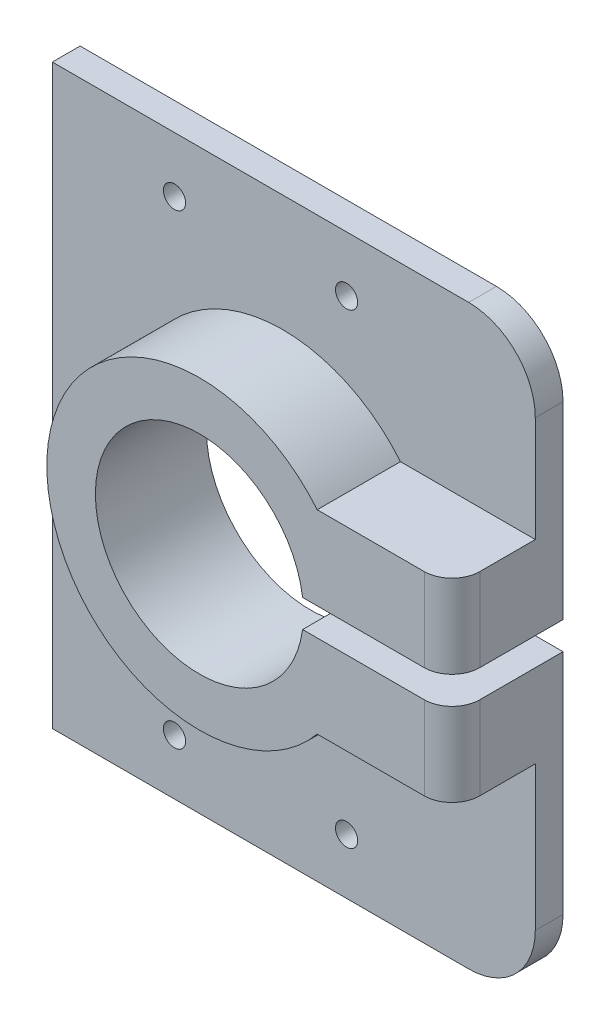
ISO-10303-21;
HEADER;
FILE_DESCRIPTION(('STEP AP214'),'2;1');
FILE_NAME('part.step','',(''),(''),'','','');
FILE_SCHEMA(('AUTOMOTIVE_DESIGN { 1 0 10303 214 1 1 1 1 }'));
ENDSEC;
DATA;
#1=APPLICATION_CONTEXT('core data for automotive mechanical design processes');
#2=APPLICATION_PROTOCOL_DEFINITION('international standard','automotive_design',2000,#1);
#3=PRODUCT_CONTEXT('',#1,'mechanical');
#4=PRODUCT('Part','Part','',(#3));
#5=PRODUCT_RELATED_PRODUCT_CATEGORY('part','',(#4));
#6=PRODUCT_DEFINITION_FORMATION('','',#4);
#7=PRODUCT_DEFINITION_CONTEXT('part definition',#1,'design');
#8=PRODUCT_DEFINITION('design','',#6,#7);
#9=PRODUCT_DEFINITION_SHAPE('','',#8);
#10=(LENGTH_UNIT() NAMED_UNIT(*) SI_UNIT(.MILLI.,.METRE.));
#11=(NAMED_UNIT(*) PLANE_ANGLE_UNIT() SI_UNIT($,.RADIAN.));
#12=(NAMED_UNIT(*) SI_UNIT($,.STERADIAN.) SOLID_ANGLE_UNIT());
#13=UNCERTAINTY_MEASURE_WITH_UNIT(LENGTH_MEASURE(1.E-05),#10,'distance_accuracy_value','');
#14=(GEOMETRIC_REPRESENTATION_CONTEXT(3) GLOBAL_UNCERTAINTY_ASSIGNED_CONTEXT((#13)) GLOBAL_UNIT_ASSIGNED_CONTEXT((#10,
#11,#12)) REPRESENTATION_CONTEXT('',''));
#15=CARTESIAN_POINT('',(0.,0.,0.));
#16=DIRECTION('',(0.,0.,1.));
#17=DIRECTION('',(1.,0.,0.));
#18=AXIS2_PLACEMENT_3D('',#15,#16,#17);
#19=CARTESIAN_POINT('',(43.5,0.,5.));
#20=DIRECTION('',(-1.,0.,0.));
#21=DIRECTION('',(0.,0.,1.));
#22=AXIS2_PLACEMENT_3D('',#19,#20,#21);
#23=PLANE('',#22);
#24=DIRECTION('',(0.,0.,-1.));
#25=VECTOR('',#24,1.);
#26=CARTESIAN_POINT('',(43.5,21.0000003129244,20.));
#27=LINE('',#26,#25);
#28=CARTESIAN_POINT('',(43.5,21.0000003129244,15.));
#29=VERTEX_POINT('',#28);
#30=CARTESIAN_POINT('',(43.5,21.0000003129244,5.));
#31=VERTEX_POINT('',#30);
#32=EDGE_CURVE('E201',#29,#31,#27,.T.);
#33=ORIENTED_EDGE('',*,*,#32,.F.);
#34=DIRECTION('',(0.,1.,0.));
#35=VECTOR('',#34,1.);
#36=CARTESIAN_POINT('',(43.5,6.,15.));
#37=LINE('',#36,#35);
#38=CARTESIAN_POINT('',(43.5,6.,15.));
#39=VERTEX_POINT('',#38);
#40=EDGE_CURVE('E43',#29,#39,#37,.F.);
#41=ORIENTED_EDGE('',*,*,#40,.T.);
#42=DIRECTION('',(0.,0.,-1.));
#43=VECTOR('',#42,1.);
#44=CARTESIAN_POINT('',(43.5,6.,20.));
#45=LINE('',#44,#43);
#46=CARTESIAN_POINT('',(43.5,6.,0.));
#47=VERTEX_POINT('',#46);
#48=EDGE_CURVE('E157',#39,#47,#45,.T.);
#49=ORIENTED_EDGE('',*,*,#48,.T.);
#50=DIRECTION('',(0.,1.,0.));
#51=VECTOR('',#50,1.);
#52=CARTESIAN_POINT('',(43.5,0.,0.));
#53=LINE('',#52,#51);
#54=CARTESIAN_POINT('',(43.5,40.,0.));
#55=VERTEX_POINT('',#54);
#56=EDGE_CURVE('E255',#47,#55,#53,.T.);
#57=ORIENTED_EDGE('',*,*,#56,.T.);
#58=DIRECTION('',(0.,0.,-1.));
#59=VECTOR('',#58,1.);
#60=CARTESIAN_POINT('',(43.5,40.,5.));
#61=LINE('',#60,#59);
#62=CARTESIAN_POINT('',(43.5,40.,5.));
#63=VERTEX_POINT('',#62);
#64=EDGE_CURVE('E292',#63,#55,#61,.T.);
#65=ORIENTED_EDGE('',*,*,#64,.F.);
#66=DIRECTION('',(0.,1.,0.));
#67=VECTOR('',#66,1.);
#68=CARTESIAN_POINT('',(43.5,0.,5.));
#69=LINE('',#68,#67);
#70=EDGE_CURVE('E220',#31,#63,#69,.T.);
#71=ORIENTED_EDGE('',*,*,#70,.F.);
#72=EDGE_LOOP('',(#33,#41,#49,#57,#65,#71));
#73=FACE_BOUND('',#72,.T.);
#74=ADVANCED_FACE('F35',(#73),#23,.F.);
#75=CARTESIAN_POINT('',(31.5,40.,5.));
#76=DIRECTION('',(0.,0.,-1.));
#77=DIRECTION('',(-1.,0.,0.));
#78=AXIS2_PLACEMENT_3D('',#75,#76,#77);
#79=CYLINDRICAL_SURFACE('',#78,12.);
#80=CARTESIAN_POINT('',(31.5,40.,0.));
#81=DIRECTION('',(0.,0.,1.));
#82=DIRECTION('',(1.,0.,0.));
#83=AXIS2_PLACEMENT_3D('',#80,#81,#82);
#84=CIRCLE('',#83,12.);
#85=CARTESIAN_POINT('',(31.5,52.,0.));
#86=VERTEX_POINT('',#85);
#87=EDGE_CURVE('E258',#55,#86,#84,.T.);
#88=ORIENTED_EDGE('',*,*,#87,.T.);
#89=DIRECTION('',(0.,0.,-1.));
#90=VECTOR('',#89,1.);
#91=CARTESIAN_POINT('',(31.5,52.,5.));
#92=LINE('',#91,#90);
#93=CARTESIAN_POINT('',(31.5,52.,5.));
#94=VERTEX_POINT('',#93);
#95=EDGE_CURVE('E289',#94,#86,#92,.T.);
#96=ORIENTED_EDGE('',*,*,#95,.F.);
#97=CARTESIAN_POINT('',(31.5,40.,5.));
#98=DIRECTION('',(0.,0.,1.));
#99=DIRECTION('',(1.,0.,0.));
#100=AXIS2_PLACEMENT_3D('',#97,#98,#99);
#101=CIRCLE('',#100,12.);
#102=EDGE_CURVE('E223',#63,#94,#101,.T.);
#103=ORIENTED_EDGE('',*,*,#102,.F.);
#104=ORIENTED_EDGE('',*,*,#64,.T.);
#105=EDGE_LOOP('',(#88,#96,#103,#104));
#106=FACE_BOUND('',#105,.T.);
#107=ADVANCED_FACE('F350',(#106),#79,.T.);
#108=CARTESIAN_POINT('',(0.,52.,5.));
#109=DIRECTION('',(0.,-1.,0.));
#110=DIRECTION('',(0.,0.,-1.));
#111=AXIS2_PLACEMENT_3D('',#108,#109,#110);
#112=PLANE('',#111);
#113=DIRECTION('',(-1.,0.,0.));
#114=VECTOR('',#113,1.);
#115=CARTESIAN_POINT('',(0.,52.,0.));
#116=LINE('',#115,#114);
#117=CARTESIAN_POINT('',(-43.5,52.,0.));
#118=VERTEX_POINT('',#117);
#119=EDGE_CURVE('E261',#86,#118,#116,.T.);
#120=ORIENTED_EDGE('',*,*,#119,.T.);
#121=DIRECTION('',(0.,0.,-1.));
#122=VECTOR('',#121,1.);
#123=CARTESIAN_POINT('',(-43.5,52.,5.));
#124=LINE('',#123,#122);
#125=CARTESIAN_POINT('',(-43.5,52.,5.));
#126=VERTEX_POINT('',#125);
#127=EDGE_CURVE('E286',#126,#118,#124,.T.);
#128=ORIENTED_EDGE('',*,*,#127,.F.);
#129=DIRECTION('',(-1.,0.,0.));
#130=VECTOR('',#129,1.);
#131=CARTESIAN_POINT('',(0.,52.,5.));
#132=LINE('',#131,#130);
#133=EDGE_CURVE('E226',#94,#126,#132,.T.);
#134=ORIENTED_EDGE('',*,*,#133,.F.);
#135=ORIENTED_EDGE('',*,*,#95,.T.);
#136=EDGE_LOOP('',(#120,#128,#134,#135));
#137=FACE_BOUND('',#136,.T.);
#138=ADVANCED_FACE('F346',(#137),#112,.F.);
#139=CARTESIAN_POINT('',(-43.5,0.,5.));
#140=DIRECTION('',(1.,0.,0.));
#141=DIRECTION('',(0.,0.,-1.));
#142=AXIS2_PLACEMENT_3D('',#139,#140,#141);
#143=PLANE('',#142);
#144=DIRECTION('',(0.,-1.,0.));
#145=VECTOR('',#144,1.);
#146=CARTESIAN_POINT('',(-43.5,0.,0.));
#147=LINE('',#146,#145);
#148=CARTESIAN_POINT('',(-43.5,-52.,0.));
#149=VERTEX_POINT('',#148);
#150=EDGE_CURVE('E264',#118,#149,#147,.T.);
#151=ORIENTED_EDGE('',*,*,#150,.T.);
#152=DIRECTION('',(0.,0.,-1.));
#153=VECTOR('',#152,1.);
#154=CARTESIAN_POINT('',(-43.5,-52.,5.));
#155=LINE('',#154,#153);
#156=CARTESIAN_POINT('',(-43.5,-52.,5.));
#157=VERTEX_POINT('',#156);
#158=EDGE_CURVE('E283',#157,#149,#155,.T.);
#159=ORIENTED_EDGE('',*,*,#158,.F.);
#160=DIRECTION('',(0.,-1.,0.));
#161=VECTOR('',#160,1.);
#162=CARTESIAN_POINT('',(-43.5,0.,5.));
#163=LINE('',#162,#161);
#164=EDGE_CURVE('E229',#126,#157,#163,.T.);
#165=ORIENTED_EDGE('',*,*,#164,.F.);
#166=ORIENTED_EDGE('',*,*,#127,.T.);
#167=EDGE_LOOP('',(#151,#159,#165,#166));
#168=FACE_BOUND('',#167,.T.);
#169=ADVANCED_FACE('F343',(#168),#143,.F.);
#170=CARTESIAN_POINT('',(0.,-52.,5.));
#171=DIRECTION('',(0.,1.,0.));
#172=DIRECTION('',(0.,0.,1.));
#173=AXIS2_PLACEMENT_3D('',#170,#171,#172);
#174=PLANE('',#173);
#175=DIRECTION('',(1.,0.,0.));
#176=VECTOR('',#175,1.);
#177=CARTESIAN_POINT('',(0.,-52.,0.));
#178=LINE('',#177,#176);
#179=CARTESIAN_POINT('',(31.5,-52.,0.));
#180=VERTEX_POINT('',#179);
#181=EDGE_CURVE('E267',#149,#180,#178,.T.);
#182=ORIENTED_EDGE('',*,*,#181,.T.);
#183=DIRECTION('',(0.,0.,-1.));
#184=VECTOR('',#183,1.);
#185=CARTESIAN_POINT('',(31.5,-52.,5.));
#186=LINE('',#185,#184);
#187=CARTESIAN_POINT('',(31.5,-52.,5.));
#188=VERTEX_POINT('',#187);
#189=EDGE_CURVE('E280',#188,#180,#186,.T.);
#190=ORIENTED_EDGE('',*,*,#189,.F.);
#191=DIRECTION('',(1.,0.,0.));
#192=VECTOR('',#191,1.);
#193=CARTESIAN_POINT('',(0.,-52.,5.));
#194=LINE('',#193,#192);
#195=EDGE_CURVE('E232',#157,#188,#194,.T.);
#196=ORIENTED_EDGE('',*,*,#195,.F.);
#197=ORIENTED_EDGE('',*,*,#158,.T.);
#198=EDGE_LOOP('',(#182,#190,#196,#197));
#199=FACE_BOUND('',#198,.T.);
#200=ADVANCED_FACE('F341',(#199),#174,.F.);
#201=CARTESIAN_POINT('',(31.5,-40.,5.));
#202=DIRECTION('',(0.,0.,-1.));
#203=DIRECTION('',(-1.,0.,0.));
#204=AXIS2_PLACEMENT_3D('',#201,#202,#203);
#205=CYLINDRICAL_SURFACE('',#204,12.);
#206=CARTESIAN_POINT('',(31.5,-40.,0.));
#207=DIRECTION('',(0.,0.,1.));
#208=DIRECTION('',(1.,0.,0.));
#209=AXIS2_PLACEMENT_3D('',#206,#207,#208);
#210=CIRCLE('',#209,12.);
#211=CARTESIAN_POINT('',(43.5,-40.,0.));
#212=VERTEX_POINT('',#211);
#213=EDGE_CURVE('E270',#180,#212,#210,.T.);
#214=ORIENTED_EDGE('',*,*,#213,.T.);
#215=DIRECTION('',(0.,0.,-1.));
#216=VECTOR('',#215,1.);
#217=CARTESIAN_POINT('',(43.5,-40.,5.));
#218=LINE('',#217,#216);
#219=CARTESIAN_POINT('',(43.5,-40.,5.));
#220=VERTEX_POINT('',#219);
#221=EDGE_CURVE('E246',#220,#212,#218,.T.);
#222=ORIENTED_EDGE('',*,*,#221,.F.);
#223=CARTESIAN_POINT('',(31.5,-40.,5.));
#224=DIRECTION('',(0.,0.,1.));
#225=DIRECTION('',(1.,0.,0.));
#226=AXIS2_PLACEMENT_3D('',#223,#224,#225);
#227=CIRCLE('',#226,12.);
#228=EDGE_CURVE('E235',#188,#220,#227,.T.);
#229=ORIENTED_EDGE('',*,*,#228,.F.);
#230=ORIENTED_EDGE('',*,*,#189,.T.);
#231=EDGE_LOOP('',(#214,#222,#229,#230));
#232=FACE_BOUND('',#231,.T.);
#233=ADVANCED_FACE('F338',(#232),#205,.T.);
#234=CARTESIAN_POINT('',(43.5,0.,5.));
#235=DIRECTION('',(-1.,0.,0.));
#236=DIRECTION('',(0.,0.,1.));
#237=AXIS2_PLACEMENT_3D('',#234,#235,#236);
#238=PLANE('',#237);
#239=DIRECTION('',(0.,0.,-1.));
#240=VECTOR('',#239,1.);
#241=CARTESIAN_POINT('',(43.5,1.,20.));
#242=LINE('',#241,#240);
#243=CARTESIAN_POINT('',(43.5,1.,15.));
#244=VERTEX_POINT('',#243);
#245=CARTESIAN_POINT('',(43.5,1.,0.));
#246=VERTEX_POINT('',#245);
#247=EDGE_CURVE('E191',#244,#246,#242,.T.);
#248=ORIENTED_EDGE('',*,*,#247,.F.);
#249=DIRECTION('',(0.,1.,0.));
#250=VECTOR('',#249,1.);
#251=CARTESIAN_POINT('',(43.5,-14.0000002086163,15.));
#252=LINE('',#251,#250);
#253=CARTESIAN_POINT('',(43.5,-14.0000002086163,15.));
#254=VERTEX_POINT('',#253);
#255=EDGE_CURVE('E301',#244,#254,#252,.F.);
#256=ORIENTED_EDGE('',*,*,#255,.T.);
#257=DIRECTION('',(0.,0.,-1.));
#258=VECTOR('',#257,1.);
#259=CARTESIAN_POINT('',(43.5,-14.0000002086163,20.));
#260=LINE('',#259,#258);
#261=CARTESIAN_POINT('',(43.5,-14.0000002086163,5.));
#262=VERTEX_POINT('',#261);
#263=EDGE_CURVE('E193',#254,#262,#260,.T.);
#264=ORIENTED_EDGE('',*,*,#263,.T.);
#265=DIRECTION('',(0.,1.,0.));
#266=VECTOR('',#265,1.);
#267=CARTESIAN_POINT('',(43.5,0.,5.));
#268=LINE('',#267,#266);
#269=EDGE_CURVE('E238',#220,#262,#268,.T.);
#270=ORIENTED_EDGE('',*,*,#269,.F.);
#271=ORIENTED_EDGE('',*,*,#221,.T.);
#272=DIRECTION('',(0.,1.,0.));
#273=VECTOR('',#272,1.);
#274=CARTESIAN_POINT('',(43.5,0.,0.));
#275=LINE('',#274,#273);
#276=EDGE_CURVE('E273',#212,#246,#275,.T.);
#277=ORIENTED_EDGE('',*,*,#276,.T.);
#278=EDGE_LOOP('',(#248,#256,#264,#270,#271,#277));
#279=FACE_BOUND('',#278,.T.);
#280=ADVANCED_FACE('F321',(#279),#238,.F.);
#281=CARTESIAN_POINT('',(9.50000000000001,-42.,5.));
#282=DIRECTION('',(0.,0.,-1.));
#283=DIRECTION('',(-1.,0.,0.));
#284=AXIS2_PLACEMENT_3D('',#281,#282,#283);
#285=CYLINDRICAL_SURFACE('',#284,2.);
#286=CARTESIAN_POINT('',(9.50000000000001,-42.,5.));
#287=DIRECTION('',(0.,0.,1.));
#288=DIRECTION('',(1.,0.,0.));
#289=AXIS2_PLACEMENT_3D('',#286,#287,#288);
#290=CIRCLE('',#289,2.);
#291=CARTESIAN_POINT('',(11.5,-42.,5.));
#292=VERTEX_POINT('',#291);
#293=EDGE_CURVE('E211',#292,#292,#290,.T.);
#294=ORIENTED_EDGE('',*,*,#293,.T.);
#295=EDGE_LOOP('',(#294));
#296=FACE_BOUND('',#295,.T.);
#297=CARTESIAN_POINT('',(9.50000000000001,-42.,0.));
#298=DIRECTION('',(0.,0.,1.));
#299=DIRECTION('',(1.,0.,0.));
#300=AXIS2_PLACEMENT_3D('',#297,#298,#299);
#301=CIRCLE('',#300,2.);
#302=CARTESIAN_POINT('',(11.5,-42.,0.));
#303=VERTEX_POINT('',#302);
#304=EDGE_CURVE('E252',#303,#303,#301,.T.);
#305=ORIENTED_EDGE('',*,*,#304,.F.);
#306=EDGE_LOOP('',(#305));
#307=FACE_BOUND('',#306,.T.);
#308=ADVANCED_FACE('F360',(#296,#307),#285,.F.);
#309=CARTESIAN_POINT('',(-21.5,-42.,5.));
#310=DIRECTION('',(0.,0.,-1.));
#311=DIRECTION('',(-1.,0.,0.));
#312=AXIS2_PLACEMENT_3D('',#309,#310,#311);
#313=CYLINDRICAL_SURFACE('',#312,2.);
#314=CARTESIAN_POINT('',(-21.5,-42.,5.));
#315=DIRECTION('',(0.,0.,1.));
#316=DIRECTION('',(1.,0.,0.));
#317=AXIS2_PLACEMENT_3D('',#314,#315,#316);
#318=CIRCLE('',#317,2.);
#319=CARTESIAN_POINT('',(-19.5,-42.,5.));
#320=VERTEX_POINT('',#319);
#321=EDGE_CURVE('E207',#320,#320,#318,.T.);
#322=ORIENTED_EDGE('',*,*,#321,.T.);
#323=EDGE_LOOP('',(#322));
#324=FACE_BOUND('',#323,.T.);
#325=CARTESIAN_POINT('',(-21.5,-42.,0.));
#326=DIRECTION('',(0.,0.,1.));
#327=DIRECTION('',(1.,0.,0.));
#328=AXIS2_PLACEMENT_3D('',#325,#326,#327);
#329=CIRCLE('',#328,2.);
#330=CARTESIAN_POINT('',(-19.5,-42.,0.));
#331=VERTEX_POINT('',#330);
#332=EDGE_CURVE('E249',#331,#331,#329,.T.);
#333=ORIENTED_EDGE('',*,*,#332,.F.);
#334=EDGE_LOOP('',(#333));
#335=FACE_BOUND('',#334,.T.);
#336=ADVANCED_FACE('F363',(#324,#335),#313,.F.);
#337=CARTESIAN_POINT('',(9.50000000000001,42.,5.));
#338=DIRECTION('',(0.,0.,-1.));
#339=DIRECTION('',(-1.,0.,0.));
#340=AXIS2_PLACEMENT_3D('',#337,#338,#339);
#341=CYLINDRICAL_SURFACE('',#340,2.);
#342=CARTESIAN_POINT('',(9.50000000000001,42.,5.));
#343=DIRECTION('',(0.,0.,1.));
#344=DIRECTION('',(1.,0.,0.));
#345=AXIS2_PLACEMENT_3D('',#342,#343,#344);
#346=CIRCLE('',#345,2.);
#347=CARTESIAN_POINT('',(11.5,42.,5.));
#348=VERTEX_POINT('',#347);
#349=EDGE_CURVE('E204',#348,#348,#346,.T.);
#350=ORIENTED_EDGE('',*,*,#349,.T.);
#351=EDGE_LOOP('',(#350));
#352=FACE_BOUND('',#351,.T.);
#353=CARTESIAN_POINT('',(9.50000000000001,42.,0.));
#354=DIRECTION('',(0.,0.,1.));
#355=DIRECTION('',(1.,0.,0.));
#356=AXIS2_PLACEMENT_3D('',#353,#354,#355);
#357=CIRCLE('',#356,2.);
#358=CARTESIAN_POINT('',(11.5,42.,0.));
#359=VERTEX_POINT('',#358);
#360=EDGE_CURVE('E156',#359,#359,#357,.T.);
#361=ORIENTED_EDGE('',*,*,#360,.F.);
#362=EDGE_LOOP('',(#361));
#363=FACE_BOUND('',#362,.T.);
#364=ADVANCED_FACE('F367',(#352,#363),#341,.F.);
#365=CARTESIAN_POINT('',(-21.5,42.,5.));
#366=DIRECTION('',(0.,0.,-1.));
#367=DIRECTION('',(-1.,0.,0.));
#368=AXIS2_PLACEMENT_3D('',#365,#366,#367);
#369=CYLINDRICAL_SURFACE('',#368,2.);
#370=CARTESIAN_POINT('',(-21.5,42.,5.));
#371=DIRECTION('',(0.,0.,1.));
#372=DIRECTION('',(1.,0.,0.));
#373=AXIS2_PLACEMENT_3D('',#370,#371,#372);
#374=CIRCLE('',#373,2.);
#375=CARTESIAN_POINT('',(-19.5,42.,5.));
#376=VERTEX_POINT('',#375);
#377=EDGE_CURVE('E243',#376,#376,#374,.T.);
#378=ORIENTED_EDGE('',*,*,#377,.T.);
#379=EDGE_LOOP('',(#378));
#380=FACE_BOUND('',#379,.T.);
#381=CARTESIAN_POINT('',(-21.5,42.,0.));
#382=DIRECTION('',(0.,0.,1.));
#383=DIRECTION('',(1.,0.,0.));
#384=AXIS2_PLACEMENT_3D('',#381,#382,#383);
#385=CIRCLE('',#384,2.);
#386=CARTESIAN_POINT('',(-19.5,42.,0.));
#387=VERTEX_POINT('',#386);
#388=EDGE_CURVE('E208',#387,#387,#385,.T.);
#389=ORIENTED_EDGE('',*,*,#388,.F.);
#390=EDGE_LOOP('',(#389));
#391=FACE_BOUND('',#390,.T.);
#392=ADVANCED_FACE('F370',(#380,#391),#369,.F.);
#393=CARTESIAN_POINT('',(0.,0.,5.));
#394=DIRECTION('',(0.,0.,1.));
#395=DIRECTION('',(1.,0.,0.));
#396=AXIS2_PLACEMENT_3D('',#393,#394,#395);
#397=PLANE('',#396);
#398=ORIENTED_EDGE('',*,*,#349,.F.);
#399=EDGE_LOOP('',(#398));
#400=FACE_BOUND('',#399,.T.);
#401=ORIENTED_EDGE('',*,*,#321,.F.);
#402=EDGE_LOOP('',(#401));
#403=FACE_BOUND('',#402,.T.);
#404=ORIENTED_EDGE('',*,*,#293,.F.);
#405=EDGE_LOOP('',(#404));
#406=FACE_BOUND('',#405,.T.);
#407=CARTESIAN_POINT('',(-1.99999999999997,3.5,5.));
#408=DIRECTION('',(0.,0.,1.));
#409=DIRECTION('',(1.,0.,0.));
#410=AXIS2_PLACEMENT_3D('',#407,#408,#409);
#411=CIRCLE('',#410,27.5000000000001);
#412=CARTESIAN_POINT('',(19.213203177447,21.0000003129244,5.));
#413=VERTEX_POINT('',#412);
#414=CARTESIAN_POINT('',(19.213203263497,-14.0000002086163,5.));
#415=VERTEX_POINT('',#414);
#416=EDGE_CURVE('E214',#413,#415,#411,.T.);
#417=ORIENTED_EDGE('',*,*,#416,.F.);
#418=DIRECTION('',(1.,0.,0.));
#419=VECTOR('',#418,1.);
#420=CARTESIAN_POINT('',(0.,21.0000003129244,5.));
#421=LINE('',#420,#419);
#422=EDGE_CURVE('E217',#413,#31,#421,.T.);
#423=ORIENTED_EDGE('',*,*,#422,.T.);
#424=ORIENTED_EDGE('',*,*,#70,.T.);
#425=ORIENTED_EDGE('',*,*,#102,.T.);
#426=ORIENTED_EDGE('',*,*,#133,.T.);
#427=ORIENTED_EDGE('',*,*,#164,.T.);
#428=ORIENTED_EDGE('',*,*,#195,.T.);
#429=ORIENTED_EDGE('',*,*,#228,.T.);
#430=ORIENTED_EDGE('',*,*,#269,.T.);
#431=DIRECTION('',(-1.,0.,0.));
#432=VECTOR('',#431,1.);
#433=CARTESIAN_POINT('',(0.,-14.0000002086163,5.));
#434=LINE('',#433,#432);
#435=EDGE_CURVE('E241',#262,#415,#434,.T.);
#436=ORIENTED_EDGE('',*,*,#435,.T.);
#437=EDGE_LOOP('',(#417,#423,#424,#425,#426,#427,#428,#429,#430,#436));
#438=FACE_BOUND('',#437,.T.);
#439=ORIENTED_EDGE('',*,*,#377,.F.);
#440=EDGE_LOOP('',(#439));
#441=FACE_BOUND('',#440,.T.);
#442=ADVANCED_FACE('F334',(#400,#403,#406,#438,#441),#397,.T.);
#443=CARTESIAN_POINT('',(0.,0.,0.));
#444=DIRECTION('',(0.,0.,1.));
#445=DIRECTION('',(1.,0.,0.));
#446=AXIS2_PLACEMENT_3D('',#443,#444,#445);
#447=PLANE('',#446);
#448=ORIENTED_EDGE('',*,*,#56,.F.);
#449=DIRECTION('',(1.,0.,0.));
#450=VECTOR('',#449,1.);
#451=CARTESIAN_POINT('',(0.,6.,0.));
#452=LINE('',#451,#450);
#453=CARTESIAN_POINT('',(16.582585934148,6.,0.));
#454=VERTEX_POINT('',#453);
#455=EDGE_CURVE('E177',#454,#47,#452,.T.);
#456=ORIENTED_EDGE('',*,*,#455,.F.);
#457=CARTESIAN_POINT('',(-1.99999999999997,3.5,0.));
#458=DIRECTION('',(0.,0.,1.));
#459=DIRECTION('',(1.,0.,0.));
#460=AXIS2_PLACEMENT_3D('',#457,#458,#459);
#461=CIRCLE('',#460,18.7499999999998);
#462=CARTESIAN_POINT('',(16.582585934148,1.00000000000003,0.));
#463=VERTEX_POINT('',#462);
#464=EDGE_CURVE('E152',#454,#463,#461,.T.);
#465=ORIENTED_EDGE('',*,*,#464,.T.);
#466=DIRECTION('',(-1.,0.,0.));
#467=VECTOR('',#466,1.);
#468=CARTESIAN_POINT('',(0.,1.,0.));
#469=LINE('',#468,#467);
#470=EDGE_CURVE('E174',#246,#463,#469,.T.);
#471=ORIENTED_EDGE('',*,*,#470,.F.);
#472=ORIENTED_EDGE('',*,*,#276,.F.);
#473=ORIENTED_EDGE('',*,*,#213,.F.);
#474=ORIENTED_EDGE('',*,*,#181,.F.);
#475=ORIENTED_EDGE('',*,*,#150,.F.);
#476=ORIENTED_EDGE('',*,*,#119,.F.);
#477=ORIENTED_EDGE('',*,*,#87,.F.);
#478=EDGE_LOOP('',(#448,#456,#465,#471,#472,#473,#474,#475,#476,#477));
#479=FACE_BOUND('',#478,.T.);
#480=ORIENTED_EDGE('',*,*,#360,.T.);
#481=EDGE_LOOP('',(#480));
#482=FACE_BOUND('',#481,.T.);
#483=ORIENTED_EDGE('',*,*,#332,.T.);
#484=EDGE_LOOP('',(#483));
#485=FACE_BOUND('',#484,.T.);
#486=ORIENTED_EDGE('',*,*,#304,.T.);
#487=EDGE_LOOP('',(#486));
#488=FACE_BOUND('',#487,.T.);
#489=ORIENTED_EDGE('',*,*,#388,.T.);
#490=EDGE_LOOP('',(#489));
#491=FACE_BOUND('',#490,.T.);
#492=ADVANCED_FACE('F326',(#479,#482,#485,#488,#491),#447,.F.);
#493=CARTESIAN_POINT('',(-1.99999999999997,3.5,20.));
#494=DIRECTION('',(0.,0.,-1.));
#495=DIRECTION('',(-1.,0.,0.));
#496=AXIS2_PLACEMENT_3D('',#493,#494,#495);
#497=CYLINDRICAL_SURFACE('',#496,18.7499999999998);
#498=ORIENTED_EDGE('',*,*,#464,.F.);
#499=DIRECTION('',(0.,0.,-1.));
#500=VECTOR('',#499,1.);
#501=CARTESIAN_POINT('',(16.582585934148,6.,20.));
#502=LINE('',#501,#500);
#503=CARTESIAN_POINT('',(16.582585934148,6.,20.));
#504=VERTEX_POINT('',#503);
#505=EDGE_CURVE('E146',#504,#454,#502,.T.);
#506=ORIENTED_EDGE('',*,*,#505,.F.);
#507=CARTESIAN_POINT('',(-1.99999999999997,3.5,20.));
#508=DIRECTION('',(0.,0.,1.));
#509=DIRECTION('',(1.,0.,0.));
#510=AXIS2_PLACEMENT_3D('',#507,#508,#509);
#511=CIRCLE('',#510,18.7499999999998);
#512=CARTESIAN_POINT('',(16.582585934148,1.00000000000003,20.));
#513=VERTEX_POINT('',#512);
#514=EDGE_CURVE('E150',#504,#513,#511,.T.);
#515=ORIENTED_EDGE('',*,*,#514,.T.);
#516=DIRECTION('',(0.,0.,-1.));
#517=VECTOR('',#516,1.);
#518=CARTESIAN_POINT('',(16.582585934148,1.00000000000003,20.));
#519=LINE('',#518,#517);
#520=EDGE_CURVE('E187',#513,#463,#519,.T.);
#521=ORIENTED_EDGE('',*,*,#520,.T.);
#522=EDGE_LOOP('',(#498,#506,#515,#521));
#523=FACE_BOUND('',#522,.T.);
#524=ADVANCED_FACE('F148',(#523),#497,.F.);
#525=CARTESIAN_POINT('',(0.,6.,20.));
#526=DIRECTION('',(0.,1.,0.));
#527=DIRECTION('',(0.,0.,1.));
#528=AXIS2_PLACEMENT_3D('',#525,#526,#527);
#529=PLANE('',#528);
#530=ORIENTED_EDGE('',*,*,#48,.F.);
#531=CARTESIAN_POINT('',(38.5,6.,15.));
#532=DIRECTION('',(0.,1.,0.));
#533=DIRECTION('',(0.,0.,1.));
#534=AXIS2_PLACEMENT_3D('',#531,#532,#533);
#535=CIRCLE('',#534,5.);
#536=CARTESIAN_POINT('',(38.5,6.,20.));
#537=VERTEX_POINT('',#536);
#538=EDGE_CURVE('E11',#39,#537,#535,.F.);
#539=ORIENTED_EDGE('',*,*,#538,.T.);
#540=DIRECTION('',(1.,0.,0.));
#541=VECTOR('',#540,1.);
#542=CARTESIAN_POINT('',(0.,6.,20.));
#543=LINE('',#542,#541);
#544=EDGE_CURVE('E160',#504,#537,#543,.T.);
#545=ORIENTED_EDGE('',*,*,#544,.F.);
#546=ORIENTED_EDGE('',*,*,#505,.T.);
#547=ORIENTED_EDGE('',*,*,#455,.T.);
#548=EDGE_LOOP('',(#530,#539,#545,#546,#547));
#549=FACE_BOUND('',#548,.T.);
#550=ADVANCED_FACE('F161',(#549),#529,.F.);
#551=CARTESIAN_POINT('',(0.,21.0000003129244,20.));
#552=DIRECTION('',(0.,1.,0.));
#553=DIRECTION('',(0.,0.,1.));
#554=AXIS2_PLACEMENT_3D('',#551,#552,#553);
#555=PLANE('',#554);
#556=DIRECTION('',(1.,0.,0.));
#557=VECTOR('',#556,1.);
#558=CARTESIAN_POINT('',(0.,21.0000003129244,20.));
#559=LINE('',#558,#557);
#560=CARTESIAN_POINT('',(19.213203177447,21.0000003129244,20.));
#561=VERTEX_POINT('',#560);
#562=CARTESIAN_POINT('',(38.5,21.0000003129244,20.));
#563=VERTEX_POINT('',#562);
#564=EDGE_CURVE('E166',#561,#563,#559,.T.);
#565=ORIENTED_EDGE('',*,*,#564,.T.);
#566=CARTESIAN_POINT('',(38.5,21.0000003129244,15.));
#567=DIRECTION('',(0.,1.,0.));
#568=DIRECTION('',(0.,0.,1.));
#569=AXIS2_PLACEMENT_3D('',#566,#567,#568);
#570=CIRCLE('',#569,5.);
#571=EDGE_CURVE('E57',#563,#29,#570,.T.);
#572=ORIENTED_EDGE('',*,*,#571,.T.);
#573=ORIENTED_EDGE('',*,*,#32,.T.);
#574=ORIENTED_EDGE('',*,*,#422,.F.);
#575=DIRECTION('',(0.,0.,-1.));
#576=VECTOR('',#575,1.);
#577=CARTESIAN_POINT('',(19.213203177447,21.0000003129244,20.));
#578=LINE('',#577,#576);
#579=EDGE_CURVE('E198',#561,#413,#578,.T.);
#580=ORIENTED_EDGE('',*,*,#579,.F.);
#581=EDGE_LOOP('',(#565,#572,#573,#574,#580));
#582=FACE_BOUND('',#581,.T.);
#583=ADVANCED_FACE('F329',(#582),#555,.T.);
#584=CARTESIAN_POINT('',(-1.99999999999997,3.5,20.));
#585=DIRECTION('',(0.,0.,-1.));
#586=DIRECTION('',(-1.,0.,0.));
#587=AXIS2_PLACEMENT_3D('',#584,#585,#586);
#588=CYLINDRICAL_SURFACE('',#587,27.5000000000001);
#589=ORIENTED_EDGE('',*,*,#416,.T.);
#590=DIRECTION('',(0.,0.,-1.));
#591=VECTOR('',#590,1.);
#592=CARTESIAN_POINT('',(19.213203263497,-14.0000002086163,20.));
#593=LINE('',#592,#591);
#594=CARTESIAN_POINT('',(19.213203263497,-14.0000002086163,20.));
#595=VERTEX_POINT('',#594);
#596=EDGE_CURVE('E195',#595,#415,#593,.T.);
#597=ORIENTED_EDGE('',*,*,#596,.F.);
#598=CARTESIAN_POINT('',(-1.99999999999997,3.5,20.));
#599=DIRECTION('',(0.,0.,1.));
#600=DIRECTION('',(1.,0.,0.));
#601=AXIS2_PLACEMENT_3D('',#598,#599,#600);
#602=CIRCLE('',#601,27.5000000000001);
#603=EDGE_CURVE('E181',#561,#595,#602,.T.);
#604=ORIENTED_EDGE('',*,*,#603,.F.);
#605=ORIENTED_EDGE('',*,*,#579,.T.);
#606=EDGE_LOOP('',(#589,#597,#604,#605));
#607=FACE_BOUND('',#606,.T.);
#608=ADVANCED_FACE('F332',(#607),#588,.T.);
#609=CARTESIAN_POINT('',(0.,-14.0000002086163,20.));
#610=DIRECTION('',(0.,-1.,0.));
#611=DIRECTION('',(0.,0.,-1.));
#612=AXIS2_PLACEMENT_3D('',#609,#610,#611);
#613=PLANE('',#612);
#614=ORIENTED_EDGE('',*,*,#263,.F.);
#615=CARTESIAN_POINT('',(38.5,-14.0000002086163,15.));
#616=DIRECTION('',(0.,-1.,0.));
#617=DIRECTION('',(0.,0.,-1.));
#618=AXIS2_PLACEMENT_3D('',#615,#616,#617);
#619=CIRCLE('',#618,5.);
#620=CARTESIAN_POINT('',(38.5,-14.0000002086163,20.));
#621=VERTEX_POINT('',#620);
#622=EDGE_CURVE('E303',#254,#621,#619,.T.);
#623=ORIENTED_EDGE('',*,*,#622,.T.);
#624=DIRECTION('',(-1.,0.,0.));
#625=VECTOR('',#624,1.);
#626=CARTESIAN_POINT('',(0.,-14.0000002086163,20.));
#627=LINE('',#626,#625);
#628=EDGE_CURVE('E184',#621,#595,#627,.T.);
#629=ORIENTED_EDGE('',*,*,#628,.T.);
#630=ORIENTED_EDGE('',*,*,#596,.T.);
#631=ORIENTED_EDGE('',*,*,#435,.F.);
#632=EDGE_LOOP('',(#614,#623,#629,#630,#631));
#633=FACE_BOUND('',#632,.T.);
#634=ADVANCED_FACE('F308',(#633),#613,.T.);
#635=CARTESIAN_POINT('',(0.,1.,20.));
#636=DIRECTION('',(0.,-1.,0.));
#637=DIRECTION('',(0.,0.,-1.));
#638=AXIS2_PLACEMENT_3D('',#635,#636,#637);
#639=PLANE('',#638);
#640=DIRECTION('',(-1.,0.,0.));
#641=VECTOR('',#640,1.);
#642=CARTESIAN_POINT('',(0.,1.,20.));
#643=LINE('',#642,#641);
#644=CARTESIAN_POINT('',(38.5,1.,20.));
#645=VERTEX_POINT('',#644);
#646=EDGE_CURVE('E172',#645,#513,#643,.T.);
#647=ORIENTED_EDGE('',*,*,#646,.F.);
#648=CARTESIAN_POINT('',(38.5,1.,15.));
#649=DIRECTION('',(0.,-1.,0.));
#650=DIRECTION('',(0.,0.,-1.));
#651=AXIS2_PLACEMENT_3D('',#648,#649,#650);
#652=CIRCLE('',#651,5.);
#653=EDGE_CURVE('E299',#645,#244,#652,.F.);
#654=ORIENTED_EDGE('',*,*,#653,.T.);
#655=ORIENTED_EDGE('',*,*,#247,.T.);
#656=ORIENTED_EDGE('',*,*,#470,.T.);
#657=ORIENTED_EDGE('',*,*,#520,.F.);
#658=EDGE_LOOP('',(#647,#654,#655,#656,#657));
#659=FACE_BOUND('',#658,.T.);
#660=ADVANCED_FACE('F319',(#659),#639,.F.);
#661=CARTESIAN_POINT('',(0.,0.,20.));
#662=DIRECTION('',(0.,0.,1.));
#663=DIRECTION('',(1.,0.,0.));
#664=AXIS2_PLACEMENT_3D('',#661,#662,#663);
#665=PLANE('',#664);
#666=ORIENTED_EDGE('',*,*,#628,.F.);
#667=DIRECTION('',(0.,1.,0.));
#668=VECTOR('',#667,1.);
#669=CARTESIAN_POINT('',(38.5,1.,20.));
#670=LINE('',#669,#668);
#671=EDGE_CURVE('E297',#621,#645,#670,.T.);
#672=ORIENTED_EDGE('',*,*,#671,.T.);
#673=ORIENTED_EDGE('',*,*,#646,.T.);
#674=ORIENTED_EDGE('',*,*,#514,.F.);
#675=ORIENTED_EDGE('',*,*,#544,.T.);
#676=DIRECTION('',(0.,1.,0.));
#677=VECTOR('',#676,1.);
#678=CARTESIAN_POINT('',(38.5,21.0000003129244,20.));
#679=LINE('',#678,#677);
#680=EDGE_CURVE('E295',#537,#563,#679,.T.);
#681=ORIENTED_EDGE('',*,*,#680,.T.);
#682=ORIENTED_EDGE('',*,*,#564,.F.);
#683=ORIENTED_EDGE('',*,*,#603,.T.);
#684=EDGE_LOOP('',(#666,#672,#673,#674,#675,#681,#682,#683));
#685=FACE_BOUND('',#684,.T.);
#686=ADVANCED_FACE('F169',(#685),#665,.T.);
#687=CARTESIAN_POINT('',(38.5,0.,15.));
#688=DIRECTION('',(0.,-1.,0.));
#689=DIRECTION('',(0.,0.,-1.));
#690=AXIS2_PLACEMENT_3D('',#687,#688,#689);
#691=CYLINDRICAL_SURFACE('',#690,5.);
#692=ORIENTED_EDGE('',*,*,#622,.F.);
#693=ORIENTED_EDGE('',*,*,#255,.F.);
#694=ORIENTED_EDGE('',*,*,#653,.F.);
#695=ORIENTED_EDGE('',*,*,#671,.F.);
#696=EDGE_LOOP('',(#692,#693,#694,#695));
#697=FACE_BOUND('',#696,.T.);
#698=ADVANCED_FACE('F316',(#697),#691,.T.);
#699=CARTESIAN_POINT('',(38.5,0.,15.));
#700=DIRECTION('',(0.,-1.,0.));
#701=DIRECTION('',(0.,0.,-1.));
#702=AXIS2_PLACEMENT_3D('',#699,#700,#701);
#703=CYLINDRICAL_SURFACE('',#702,5.);
#704=ORIENTED_EDGE('',*,*,#538,.F.);
#705=ORIENTED_EDGE('',*,*,#40,.F.);
#706=ORIENTED_EDGE('',*,*,#571,.F.);
#707=ORIENTED_EDGE('',*,*,#680,.F.);
#708=EDGE_LOOP('',(#704,#705,#706,#707));
#709=FACE_BOUND('',#708,.T.);
#710=ADVANCED_FACE('F37',(#709),#703,.T.);
#711=CLOSED_SHELL('',(#74,#107,#138,#169,#200,#233,#280,#308,#336,#364,#392,#442,#492,#524,#550,
#583,#608,#634,#660,#686,#698,#710));
#712=MANIFOLD_SOLID_BREP('B2',#711);
#713=ADVANCED_BREP_SHAPE_REPRESENTATION('',(#18,#712),#14);
#714=SHAPE_DEFINITION_REPRESENTATION(#9,#713);
ENDSEC;
END-ISO-10303-21;
